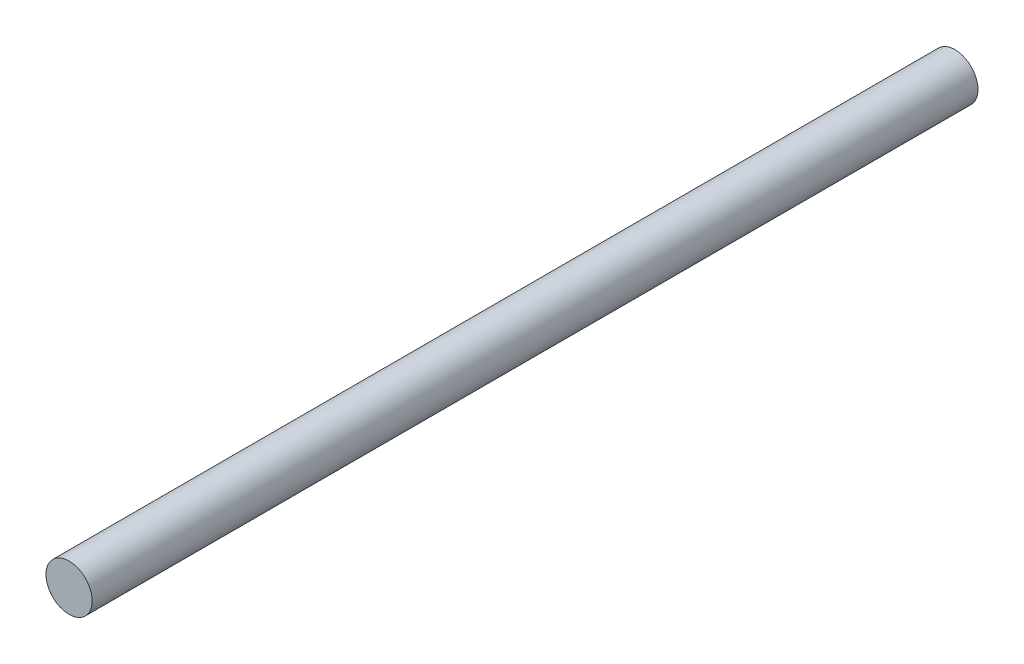
ISO-10303-21;
HEADER;
FILE_DESCRIPTION(('STEP AP214'),'2;1');
FILE_NAME('part.step','',(''),(''),'','','');
FILE_SCHEMA(('AUTOMOTIVE_DESIGN { 1 0 10303 214 1 1 1 1 }'));
ENDSEC;
DATA;
#1=APPLICATION_CONTEXT('core data for automotive mechanical design processes');
#2=APPLICATION_PROTOCOL_DEFINITION('international standard','automotive_design',2000,#1);
#3=PRODUCT_CONTEXT('',#1,'mechanical');
#4=PRODUCT('Part','Part','',(#3));
#5=PRODUCT_RELATED_PRODUCT_CATEGORY('part','',(#4));
#6=PRODUCT_DEFINITION_FORMATION('','',#4);
#7=PRODUCT_DEFINITION_CONTEXT('part definition',#1,'design');
#8=PRODUCT_DEFINITION('design','',#6,#7);
#9=PRODUCT_DEFINITION_SHAPE('','',#8);
#10=(LENGTH_UNIT() NAMED_UNIT(*) SI_UNIT(.MILLI.,.METRE.));
#11=(NAMED_UNIT(*) PLANE_ANGLE_UNIT() SI_UNIT($,.RADIAN.));
#12=(NAMED_UNIT(*) SI_UNIT($,.STERADIAN.) SOLID_ANGLE_UNIT());
#13=UNCERTAINTY_MEASURE_WITH_UNIT(LENGTH_MEASURE(1.E-05),#10,'distance_accuracy_value','');
#14=(GEOMETRIC_REPRESENTATION_CONTEXT(3) GLOBAL_UNCERTAINTY_ASSIGNED_CONTEXT((#13)) GLOBAL_UNIT_ASSIGNED_CONTEXT((#10,
#11,#12)) REPRESENTATION_CONTEXT('',''));
#15=CARTESIAN_POINT('',(0.,0.,0.));
#16=DIRECTION('',(0.,0.,1.));
#17=DIRECTION('',(1.,0.,0.));
#18=AXIS2_PLACEMENT_3D('',#15,#16,#17);
#19=CARTESIAN_POINT('',(0.,0.,19.17));
#20=DIRECTION('',(0.,0.,-1.));
#21=DIRECTION('',(-1.,0.,0.));
#22=AXIS2_PLACEMENT_3D('',#19,#20,#21);
#23=CYLINDRICAL_SURFACE('',#22,0.5);
#24=CARTESIAN_POINT('',(0.,0.,19.17));
#25=DIRECTION('',(0.,0.,1.));
#26=DIRECTION('',(1.,0.,0.));
#27=AXIS2_PLACEMENT_3D('',#24,#25,#26);
#28=CIRCLE('',#27,0.5);
#29=CARTESIAN_POINT('',(0.5,0.,19.17));
#30=VERTEX_POINT('',#29);
#31=EDGE_CURVE('E10',#30,#30,#28,.T.);
#32=ORIENTED_EDGE('',*,*,#31,.F.);
#33=EDGE_LOOP('',(#32));
#34=FACE_BOUND('',#33,.T.);
#35=CARTESIAN_POINT('',(0.,0.,0.));
#36=DIRECTION('',(0.,0.,1.));
#37=DIRECTION('',(1.,0.,0.));
#38=AXIS2_PLACEMENT_3D('',#35,#36,#37);
#39=CIRCLE('',#38,0.5);
#40=CARTESIAN_POINT('',(0.5,0.,0.));
#41=VERTEX_POINT('',#40);
#42=EDGE_CURVE('E33',#41,#41,#39,.T.);
#43=ORIENTED_EDGE('',*,*,#42,.T.);
#44=EDGE_LOOP('',(#43));
#45=FACE_BOUND('',#44,.T.);
#46=ADVANCED_FACE('F30',(#34,#45),#23,.T.);
#47=CARTESIAN_POINT('',(0.,0.,19.17));
#48=DIRECTION('',(0.,0.,1.));
#49=DIRECTION('',(1.,0.,0.));
#50=AXIS2_PLACEMENT_3D('',#47,#48,#49);
#51=PLANE('',#50);
#52=ORIENTED_EDGE('',*,*,#31,.T.);
#53=EDGE_LOOP('',(#52));
#54=FACE_BOUND('',#53,.T.);
#55=ADVANCED_FACE('F45',(#54),#51,.T.);
#56=CARTESIAN_POINT('',(0.,0.,0.));
#57=DIRECTION('',(0.,0.,1.));
#58=DIRECTION('',(1.,0.,0.));
#59=AXIS2_PLACEMENT_3D('',#56,#57,#58);
#60=PLANE('',#59);
#61=ORIENTED_EDGE('',*,*,#42,.F.);
#62=EDGE_LOOP('',(#61));
#63=FACE_BOUND('',#62,.T.);
#64=ADVANCED_FACE('F43',(#63),#60,.F.);
#65=CLOSED_SHELL('',(#46,#55,#64));
#66=MANIFOLD_SOLID_BREP('B2',#65);
#67=ADVANCED_BREP_SHAPE_REPRESENTATION('',(#18,#66),#14);
#68=SHAPE_DEFINITION_REPRESENTATION(#9,#67);
ENDSEC;
END-ISO-10303-21;
